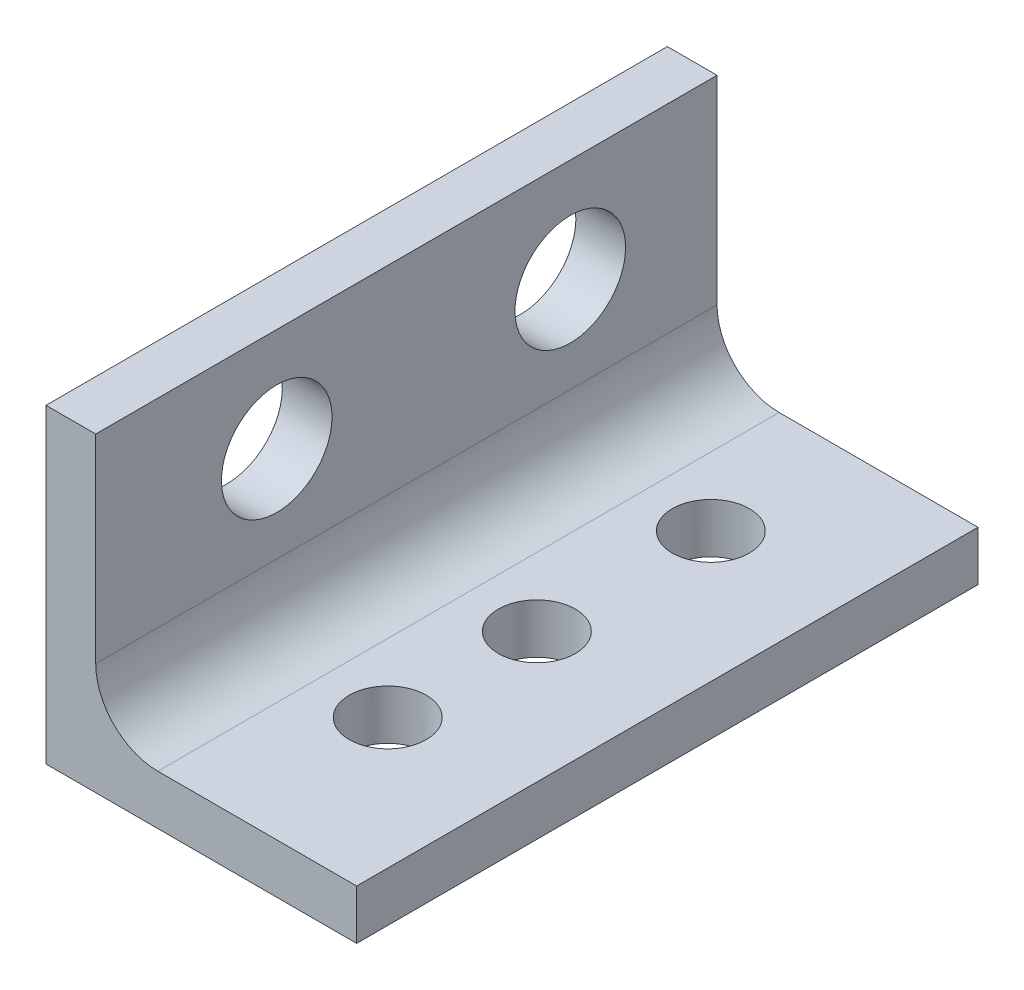
ISO-10303-21;
HEADER;
FILE_DESCRIPTION(('STEP AP214'),'2;1');
FILE_NAME('part.step','',(''),(''),'','','');
FILE_SCHEMA(('AUTOMOTIVE_DESIGN { 1 0 10303 214 1 1 1 1 }'));
ENDSEC;
DATA;
#1=APPLICATION_CONTEXT('core data for automotive mechanical design processes');
#2=APPLICATION_PROTOCOL_DEFINITION('international standard','automotive_design',2000,#1);
#3=PRODUCT_CONTEXT('',#1,'mechanical');
#4=PRODUCT('Part','Part','',(#3));
#5=PRODUCT_RELATED_PRODUCT_CATEGORY('part','',(#4));
#6=PRODUCT_DEFINITION_FORMATION('','',#4);
#7=PRODUCT_DEFINITION_CONTEXT('part definition',#1,'design');
#8=PRODUCT_DEFINITION('design','',#6,#7);
#9=PRODUCT_DEFINITION_SHAPE('','',#8);
#10=(LENGTH_UNIT() NAMED_UNIT(*) SI_UNIT(.MILLI.,.METRE.));
#11=(NAMED_UNIT(*) PLANE_ANGLE_UNIT() SI_UNIT($,.RADIAN.));
#12=(NAMED_UNIT(*) SI_UNIT($,.STERADIAN.) SOLID_ANGLE_UNIT());
#13=UNCERTAINTY_MEASURE_WITH_UNIT(LENGTH_MEASURE(1.E-05),#10,'distance_accuracy_value','');
#14=(GEOMETRIC_REPRESENTATION_CONTEXT(3) GLOBAL_UNCERTAINTY_ASSIGNED_CONTEXT((#13)) GLOBAL_UNIT_ASSIGNED_CONTEXT((#10,
#11,#12)) REPRESENTATION_CONTEXT('',''));
#15=CARTESIAN_POINT('',(0.,0.,0.));
#16=DIRECTION('',(0.,0.,1.));
#17=DIRECTION('',(1.,0.,0.));
#18=AXIS2_PLACEMENT_3D('',#15,#16,#17);
#19=CARTESIAN_POINT('',(-5.334,6.35,12.7));
#20=DIRECTION('',(0.,-1.,0.));
#21=DIRECTION('',(0.,0.,-1.));
#22=AXIS2_PLACEMENT_3D('',#19,#20,#21);
#23=PLANE('',#22);
#24=DIRECTION('',(-1.,0.,0.));
#25=VECTOR('',#24,1.);
#26=CARTESIAN_POINT('',(-5.334,6.35,0.));
#27=LINE('',#26,#25);
#28=CARTESIAN_POINT('',(-5.334,6.35,0.));
#29=VERTEX_POINT('',#28);
#30=CARTESIAN_POINT('',(-6.35,6.35,0.));
#31=VERTEX_POINT('',#30);
#32=EDGE_CURVE('E115',#29,#31,#27,.T.);
#33=ORIENTED_EDGE('',*,*,#32,.T.);
#34=DIRECTION('',(0.,0.,-1.));
#35=VECTOR('',#34,1.);
#36=CARTESIAN_POINT('',(-6.35,6.35,12.7));
#37=LINE('',#36,#35);
#38=CARTESIAN_POINT('',(-6.35,6.35,12.7));
#39=VERTEX_POINT('',#38);
#40=EDGE_CURVE('E96',#39,#31,#37,.T.);
#41=ORIENTED_EDGE('',*,*,#40,.F.);
#42=DIRECTION('',(-1.,0.,0.));
#43=VECTOR('',#42,1.);
#44=CARTESIAN_POINT('',(-5.334,6.35,12.7));
#45=LINE('',#44,#43);
#46=CARTESIAN_POINT('',(-5.334,6.35,12.7));
#47=VERTEX_POINT('',#46);
#48=EDGE_CURVE('E103',#47,#39,#45,.T.);
#49=ORIENTED_EDGE('',*,*,#48,.F.);
#50=DIRECTION('',(0.,0.,-1.));
#51=VECTOR('',#50,1.);
#52=CARTESIAN_POINT('',(-5.334,6.35,12.7));
#53=LINE('',#52,#51);
#54=EDGE_CURVE('E129',#47,#29,#53,.T.);
#55=ORIENTED_EDGE('',*,*,#54,.T.);
#56=EDGE_LOOP('',(#33,#41,#49,#55));
#57=FACE_BOUND('',#56,.T.);
#58=ADVANCED_FACE('F33',(#57),#23,.F.);
#59=CARTESIAN_POINT('',(-6.35,6.35,12.7));
#60=DIRECTION('',(1.,0.,0.));
#61=DIRECTION('',(0.,1.,0.));
#62=AXIS2_PLACEMENT_3D('',#59,#60,#61);
#63=PLANE('',#62);
#64=CARTESIAN_POINT('',(-6.35,4.24,3.));
#65=DIRECTION('',(1.,0.,0.));
#66=DIRECTION('',(0.,1.,0.));
#67=AXIS2_PLACEMENT_3D('',#64,#65,#66);
#68=CIRCLE('',#67,1.1303);
#69=CARTESIAN_POINT('',(-6.35,5.3703,3.));
#70=VERTEX_POINT('',#69);
#71=EDGE_CURVE('E171',#70,#70,#68,.F.);
#72=ORIENTED_EDGE('',*,*,#71,.F.);
#73=EDGE_LOOP('',(#72));
#74=FACE_BOUND('',#73,.T.);
#75=CARTESIAN_POINT('',(-6.35,4.24,9.));
#76=DIRECTION('',(1.,0.,0.));
#77=DIRECTION('',(0.,1.,0.));
#78=AXIS2_PLACEMENT_3D('',#75,#76,#77);
#79=CIRCLE('',#78,1.1303);
#80=CARTESIAN_POINT('',(-6.35,5.3703,9.));
#81=VERTEX_POINT('',#80);
#82=EDGE_CURVE('E165',#81,#81,#79,.F.);
#83=ORIENTED_EDGE('',*,*,#82,.F.);
#84=EDGE_LOOP('',(#83));
#85=FACE_BOUND('',#84,.T.);
#86=DIRECTION('',(0.,-1.,0.));
#87=VECTOR('',#86,1.);
#88=CARTESIAN_POINT('',(-6.35,6.35,0.));
#89=LINE('',#88,#87);
#90=CARTESIAN_POINT('',(-6.35,0.,0.));
#91=VERTEX_POINT('',#90);
#92=EDGE_CURVE('E138',#31,#91,#89,.T.);
#93=ORIENTED_EDGE('',*,*,#92,.T.);
#94=DIRECTION('',(0.,0.,-1.));
#95=VECTOR('',#94,1.);
#96=CARTESIAN_POINT('',(-6.35,0.,12.7));
#97=LINE('',#96,#95);
#98=CARTESIAN_POINT('',(-6.35,0.,12.7));
#99=VERTEX_POINT('',#98);
#100=EDGE_CURVE('E99',#99,#91,#97,.T.);
#101=ORIENTED_EDGE('',*,*,#100,.F.);
#102=DIRECTION('',(0.,-1.,0.));
#103=VECTOR('',#102,1.);
#104=CARTESIAN_POINT('',(-6.35,6.35,12.7));
#105=LINE('',#104,#103);
#106=EDGE_CURVE('E92',#39,#99,#105,.T.);
#107=ORIENTED_EDGE('',*,*,#106,.F.);
#108=ORIENTED_EDGE('',*,*,#40,.T.);
#109=EDGE_LOOP('',(#93,#101,#107,#108));
#110=FACE_BOUND('',#109,.T.);
#111=ADVANCED_FACE('F94',(#74,#85,#110),#63,.F.);
#112=CARTESIAN_POINT('',(-6.35,0.,12.7));
#113=DIRECTION('',(0.,1.,0.));
#114=DIRECTION('',(0.,0.,1.));
#115=AXIS2_PLACEMENT_3D('',#112,#113,#114);
#116=PLANE('',#115);
#117=CARTESIAN_POINT('',(-2.667,0.,2.794));
#118=DIRECTION('',(0.,1.,0.));
#119=DIRECTION('',(0.,0.,1.));
#120=AXIS2_PLACEMENT_3D('',#117,#118,#119);
#121=CIRCLE('',#120,0.7874);
#122=CARTESIAN_POINT('',(-2.667,0.,3.5814));
#123=VERTEX_POINT('',#122);
#124=EDGE_CURVE('E159',#123,#123,#121,.T.);
#125=ORIENTED_EDGE('',*,*,#124,.T.);
#126=EDGE_LOOP('',(#125));
#127=FACE_BOUND('',#126,.T.);
#128=CARTESIAN_POINT('',(-2.667,0.,9.398));
#129=DIRECTION('',(0.,1.,0.));
#130=DIRECTION('',(0.,0.,1.));
#131=AXIS2_PLACEMENT_3D('',#128,#129,#130);
#132=CIRCLE('',#131,0.787400000000001);
#133=CARTESIAN_POINT('',(-2.667,0.,10.1854));
#134=VERTEX_POINT('',#133);
#135=EDGE_CURVE('E153',#134,#134,#132,.T.);
#136=ORIENTED_EDGE('',*,*,#135,.T.);
#137=EDGE_LOOP('',(#136));
#138=FACE_BOUND('',#137,.T.);
#139=CARTESIAN_POINT('',(-2.667,0.,6.35));
#140=DIRECTION('',(0.,1.,0.));
#141=DIRECTION('',(0.,0.,1.));
#142=AXIS2_PLACEMENT_3D('',#139,#140,#141);
#143=CIRCLE('',#142,0.7874);
#144=CARTESIAN_POINT('',(-2.667,0.,7.1374));
#145=VERTEX_POINT('',#144);
#146=EDGE_CURVE('E141',#145,#145,#143,.T.);
#147=ORIENTED_EDGE('',*,*,#146,.T.);
#148=EDGE_LOOP('',(#147));
#149=FACE_BOUND('',#148,.T.);
#150=DIRECTION('',(1.,0.,0.));
#151=VECTOR('',#150,1.);
#152=CARTESIAN_POINT('',(-6.35,0.,0.));
#153=LINE('',#152,#151);
#154=CARTESIAN_POINT('',(0.,0.,0.));
#155=VERTEX_POINT('',#154);
#156=EDGE_CURVE('E136',#91,#155,#153,.T.);
#157=ORIENTED_EDGE('',*,*,#156,.T.);
#158=DIRECTION('',(0.,0.,-1.));
#159=VECTOR('',#158,1.);
#160=CARTESIAN_POINT('',(0.,0.,12.7));
#161=LINE('',#160,#159);
#162=CARTESIAN_POINT('',(0.,0.,12.7));
#163=VERTEX_POINT('',#162);
#164=EDGE_CURVE('E120',#163,#155,#161,.T.);
#165=ORIENTED_EDGE('',*,*,#164,.F.);
#166=DIRECTION('',(1.,0.,0.));
#167=VECTOR('',#166,1.);
#168=CARTESIAN_POINT('',(-6.35,0.,12.7));
#169=LINE('',#168,#167);
#170=EDGE_CURVE('E102',#99,#163,#169,.T.);
#171=ORIENTED_EDGE('',*,*,#170,.F.);
#172=ORIENTED_EDGE('',*,*,#100,.T.);
#173=EDGE_LOOP('',(#157,#165,#171,#172));
#174=FACE_BOUND('',#173,.T.);
#175=ADVANCED_FACE('F200',(#127,#138,#149,#174),#116,.F.);
#176=CARTESIAN_POINT('',(0.,1.016,12.7));
#177=DIRECTION('',(-1.,0.,0.));
#178=DIRECTION('',(0.,0.,1.));
#179=AXIS2_PLACEMENT_3D('',#176,#177,#178);
#180=PLANE('',#179);
#181=DIRECTION('',(0.,1.,0.));
#182=VECTOR('',#181,1.);
#183=CARTESIAN_POINT('',(0.,1.016,0.));
#184=LINE('',#183,#182);
#185=CARTESIAN_POINT('',(0.,1.016,0.));
#186=VERTEX_POINT('',#185);
#187=EDGE_CURVE('E134',#155,#186,#184,.T.);
#188=ORIENTED_EDGE('',*,*,#187,.T.);
#189=DIRECTION('',(0.,0.,-1.));
#190=VECTOR('',#189,1.);
#191=CARTESIAN_POINT('',(0.,1.016,12.7));
#192=LINE('',#191,#190);
#193=CARTESIAN_POINT('',(0.,1.016,12.7));
#194=VERTEX_POINT('',#193);
#195=EDGE_CURVE('E126',#194,#186,#192,.T.);
#196=ORIENTED_EDGE('',*,*,#195,.F.);
#197=DIRECTION('',(0.,1.,0.));
#198=VECTOR('',#197,1.);
#199=CARTESIAN_POINT('',(0.,1.016,12.7));
#200=LINE('',#199,#198);
#201=EDGE_CURVE('E145',#163,#194,#200,.T.);
#202=ORIENTED_EDGE('',*,*,#201,.F.);
#203=ORIENTED_EDGE('',*,*,#164,.T.);
#204=EDGE_LOOP('',(#188,#196,#202,#203));
#205=FACE_BOUND('',#204,.T.);
#206=ADVANCED_FACE('F197',(#205),#180,.F.);
#207=CARTESIAN_POINT('',(-5.334,1.016,12.7));
#208=DIRECTION('',(0.,-1.,0.));
#209=DIRECTION('',(0.,0.,-1.));
#210=AXIS2_PLACEMENT_3D('',#207,#208,#209);
#211=PLANE('',#210);
#212=CARTESIAN_POINT('',(-2.667,1.016,2.794));
#213=DIRECTION('',(0.,1.,0.));
#214=DIRECTION('',(0.,0.,-1.));
#215=AXIS2_PLACEMENT_3D('',#212,#213,#214);
#216=CIRCLE('',#215,0.7874);
#217=CARTESIAN_POINT('',(-2.667,1.016,2.0066));
#218=VERTEX_POINT('',#217);
#219=EDGE_CURVE('E162',#218,#218,#216,.T.);
#220=ORIENTED_EDGE('',*,*,#219,.F.);
#221=EDGE_LOOP('',(#220));
#222=FACE_BOUND('',#221,.T.);
#223=CARTESIAN_POINT('',(-2.667,1.016,9.398));
#224=DIRECTION('',(0.,1.,0.));
#225=DIRECTION('',(0.,0.,-1.));
#226=AXIS2_PLACEMENT_3D('',#223,#224,#225);
#227=CIRCLE('',#226,0.787400000000001);
#228=CARTESIAN_POINT('',(-2.667,1.016,8.6106));
#229=VERTEX_POINT('',#228);
#230=EDGE_CURVE('E156',#229,#229,#227,.T.);
#231=ORIENTED_EDGE('',*,*,#230,.F.);
#232=EDGE_LOOP('',(#231));
#233=FACE_BOUND('',#232,.T.);
#234=CARTESIAN_POINT('',(-2.667,1.016,6.35));
#235=DIRECTION('',(0.,1.,0.));
#236=DIRECTION('',(0.,0.,1.));
#237=AXIS2_PLACEMENT_3D('',#234,#235,#236);
#238=CIRCLE('',#237,0.7874);
#239=CARTESIAN_POINT('',(-2.667,1.016,7.1374));
#240=VERTEX_POINT('',#239);
#241=EDGE_CURVE('E150',#240,#240,#238,.T.);
#242=ORIENTED_EDGE('',*,*,#241,.F.);
#243=EDGE_LOOP('',(#242));
#244=FACE_BOUND('',#243,.T.);
#245=DIRECTION('',(-1.,0.,0.));
#246=VECTOR('',#245,1.);
#247=CARTESIAN_POINT('',(-5.334,1.016,0.));
#248=LINE('',#247,#246);
#249=CARTESIAN_POINT('',(-4.064,1.016,0.));
#250=VERTEX_POINT('',#249);
#251=EDGE_CURVE('E132',#186,#250,#248,.T.);
#252=ORIENTED_EDGE('',*,*,#251,.T.);
#253=DIRECTION('',(0.,0.,-1.));
#254=VECTOR('',#253,1.);
#255=CARTESIAN_POINT('',(-4.064,1.016,12.7));
#256=LINE('',#255,#254);
#257=CARTESIAN_POINT('',(-4.064,1.016,12.7));
#258=VERTEX_POINT('',#257);
#259=EDGE_CURVE('E48',#250,#258,#256,.F.);
#260=ORIENTED_EDGE('',*,*,#259,.T.);
#261=DIRECTION('',(-1.,0.,0.));
#262=VECTOR('',#261,1.);
#263=CARTESIAN_POINT('',(-5.334,1.016,12.7));
#264=LINE('',#263,#262);
#265=EDGE_CURVE('E143',#194,#258,#264,.T.);
#266=ORIENTED_EDGE('',*,*,#265,.F.);
#267=ORIENTED_EDGE('',*,*,#195,.T.);
#268=EDGE_LOOP('',(#252,#260,#266,#267));
#269=FACE_BOUND('',#268,.T.);
#270=ADVANCED_FACE('F184',(#222,#233,#244,#269),#211,.F.);
#271=CARTESIAN_POINT('',(-5.334,6.35,12.7));
#272=DIRECTION('',(-1.,0.,0.));
#273=DIRECTION('',(0.,-1.,0.));
#274=AXIS2_PLACEMENT_3D('',#271,#272,#273);
#275=PLANE('',#274);
#276=CARTESIAN_POINT('',(-5.334,4.24,3.));
#277=DIRECTION('',(1.,0.,0.));
#278=DIRECTION('',(0.,1.,0.));
#279=AXIS2_PLACEMENT_3D('',#276,#277,#278);
#280=CIRCLE('',#279,1.1303);
#281=CARTESIAN_POINT('',(-5.334,5.3703,3.));
#282=VERTEX_POINT('',#281);
#283=EDGE_CURVE('E174',#282,#282,#280,.T.);
#284=ORIENTED_EDGE('',*,*,#283,.F.);
#285=EDGE_LOOP('',(#284));
#286=FACE_BOUND('',#285,.T.);
#287=CARTESIAN_POINT('',(-5.334,4.24,9.));
#288=DIRECTION('',(1.,0.,0.));
#289=DIRECTION('',(0.,1.,0.));
#290=AXIS2_PLACEMENT_3D('',#287,#288,#289);
#291=CIRCLE('',#290,1.1303);
#292=CARTESIAN_POINT('',(-5.334,5.3703,9.));
#293=VERTEX_POINT('',#292);
#294=EDGE_CURVE('E168',#293,#293,#291,.T.);
#295=ORIENTED_EDGE('',*,*,#294,.F.);
#296=EDGE_LOOP('',(#295));
#297=FACE_BOUND('',#296,.T.);
#298=DIRECTION('',(0.,1.,0.));
#299=VECTOR('',#298,1.);
#300=CARTESIAN_POINT('',(-5.334,6.35,12.7));
#301=LINE('',#300,#299);
#302=CARTESIAN_POINT('',(-5.334,2.286,12.7));
#303=VERTEX_POINT('',#302);
#304=EDGE_CURVE('E108',#303,#47,#301,.T.);
#305=ORIENTED_EDGE('',*,*,#304,.F.);
#306=DIRECTION('',(0.,0.,-1.));
#307=VECTOR('',#306,1.);
#308=CARTESIAN_POINT('',(-5.334,2.286,0.));
#309=LINE('',#308,#307);
#310=CARTESIAN_POINT('',(-5.334,2.286,0.));
#311=VERTEX_POINT('',#310);
#312=EDGE_CURVE('E116',#303,#311,#309,.T.);
#313=ORIENTED_EDGE('',*,*,#312,.T.);
#314=DIRECTION('',(0.,1.,0.));
#315=VECTOR('',#314,1.);
#316=CARTESIAN_POINT('',(-5.334,6.35,0.));
#317=LINE('',#316,#315);
#318=EDGE_CURVE('E112',#311,#29,#317,.T.);
#319=ORIENTED_EDGE('',*,*,#318,.T.);
#320=ORIENTED_EDGE('',*,*,#54,.F.);
#321=EDGE_LOOP('',(#305,#313,#319,#320));
#322=FACE_BOUND('',#321,.T.);
#323=ADVANCED_FACE('F181',(#286,#297,#322),#275,.F.);
#324=CARTESIAN_POINT('',(0.,0.,12.7));
#325=DIRECTION('',(0.,0.,1.));
#326=DIRECTION('',(1.,0.,0.));
#327=AXIS2_PLACEMENT_3D('',#324,#325,#326);
#328=PLANE('',#327);
#329=ORIENTED_EDGE('',*,*,#48,.T.);
#330=ORIENTED_EDGE('',*,*,#106,.T.);
#331=ORIENTED_EDGE('',*,*,#170,.T.);
#332=ORIENTED_EDGE('',*,*,#201,.T.);
#333=ORIENTED_EDGE('',*,*,#265,.T.);
#334=CARTESIAN_POINT('',(-4.064,2.286,12.7));
#335=DIRECTION('',(0.,0.,1.));
#336=DIRECTION('',(1.,0.,0.));
#337=AXIS2_PLACEMENT_3D('',#334,#335,#336);
#338=CIRCLE('',#337,1.27);
#339=EDGE_CURVE('E11',#258,#303,#338,.F.);
#340=ORIENTED_EDGE('',*,*,#339,.T.);
#341=ORIENTED_EDGE('',*,*,#304,.T.);
#342=EDGE_LOOP('',(#329,#330,#331,#332,#333,#340,#341));
#343=FACE_BOUND('',#342,.T.);
#344=ADVANCED_FACE('F106',(#343),#328,.T.);
#345=CARTESIAN_POINT('',(0.,0.,0.));
#346=DIRECTION('',(0.,0.,1.));
#347=DIRECTION('',(1.,0.,0.));
#348=AXIS2_PLACEMENT_3D('',#345,#346,#347);
#349=PLANE('',#348);
#350=ORIENTED_EDGE('',*,*,#32,.F.);
#351=ORIENTED_EDGE('',*,*,#318,.F.);
#352=CARTESIAN_POINT('',(-4.064,2.286,0.));
#353=DIRECTION('',(0.,0.,1.));
#354=DIRECTION('',(1.,0.,0.));
#355=AXIS2_PLACEMENT_3D('',#352,#353,#354);
#356=CIRCLE('',#355,1.27);
#357=EDGE_CURVE('E41',#311,#250,#356,.T.);
#358=ORIENTED_EDGE('',*,*,#357,.T.);
#359=ORIENTED_EDGE('',*,*,#251,.F.);
#360=ORIENTED_EDGE('',*,*,#187,.F.);
#361=ORIENTED_EDGE('',*,*,#156,.F.);
#362=ORIENTED_EDGE('',*,*,#92,.F.);
#363=EDGE_LOOP('',(#350,#351,#358,#359,#360,#361,#362));
#364=FACE_BOUND('',#363,.T.);
#365=ADVANCED_FACE('F195',(#364),#349,.F.);
#366=CARTESIAN_POINT('',(-2.667,-1.524,6.35));
#367=DIRECTION('',(0.,1.,0.));
#368=DIRECTION('',(0.,0.,1.));
#369=AXIS2_PLACEMENT_3D('',#366,#367,#368);
#370=CYLINDRICAL_SURFACE('',#369,0.7874);
#371=ORIENTED_EDGE('',*,*,#241,.T.);
#372=EDGE_LOOP('',(#371));
#373=FACE_BOUND('',#372,.T.);
#374=ORIENTED_EDGE('',*,*,#146,.F.);
#375=EDGE_LOOP('',(#374));
#376=FACE_BOUND('',#375,.T.);
#377=ADVANCED_FACE('F266',(#373,#376),#370,.F.);
#378=CARTESIAN_POINT('',(-2.667,-1.524,9.398));
#379=DIRECTION('',(0.,1.,0.));
#380=DIRECTION('',(0.,0.,1.));
#381=AXIS2_PLACEMENT_3D('',#378,#379,#380);
#382=CYLINDRICAL_SURFACE('',#381,0.787400000000001);
#383=ORIENTED_EDGE('',*,*,#230,.T.);
#384=EDGE_LOOP('',(#383));
#385=FACE_BOUND('',#384,.T.);
#386=ORIENTED_EDGE('',*,*,#135,.F.);
#387=EDGE_LOOP('',(#386));
#388=FACE_BOUND('',#387,.T.);
#389=ADVANCED_FACE('F262',(#385,#388),#382,.F.);
#390=CARTESIAN_POINT('',(-2.667,-1.524,2.794));
#391=DIRECTION('',(0.,1.,0.));
#392=DIRECTION('',(0.,0.,1.));
#393=AXIS2_PLACEMENT_3D('',#390,#391,#392);
#394=CYLINDRICAL_SURFACE('',#393,0.7874);
#395=ORIENTED_EDGE('',*,*,#219,.T.);
#396=EDGE_LOOP('',(#395));
#397=FACE_BOUND('',#396,.T.);
#398=ORIENTED_EDGE('',*,*,#124,.F.);
#399=EDGE_LOOP('',(#398));
#400=FACE_BOUND('',#399,.T.);
#401=ADVANCED_FACE('F259',(#397,#400),#394,.F.);
#402=CARTESIAN_POINT('',(-4.064,2.286,12.7));
#403=DIRECTION('',(0.,0.,1.));
#404=DIRECTION('',(1.,0.,0.));
#405=AXIS2_PLACEMENT_3D('',#402,#403,#404);
#406=CYLINDRICAL_SURFACE('',#405,1.27);
#407=ORIENTED_EDGE('',*,*,#339,.F.);
#408=ORIENTED_EDGE('',*,*,#259,.F.);
#409=ORIENTED_EDGE('',*,*,#357,.F.);
#410=ORIENTED_EDGE('',*,*,#312,.F.);
#411=EDGE_LOOP('',(#407,#408,#409,#410));
#412=FACE_BOUND('',#411,.T.);
#413=ADVANCED_FACE('F35',(#412),#406,.F.);
#414=CARTESIAN_POINT('',(-6.351,4.24,9.));
#415=DIRECTION('',(1.,0.,0.));
#416=DIRECTION('',(0.,1.,0.));
#417=AXIS2_PLACEMENT_3D('',#414,#415,#416);
#418=CYLINDRICAL_SURFACE('',#417,1.1303);
#419=ORIENTED_EDGE('',*,*,#294,.T.);
#420=EDGE_LOOP('',(#419));
#421=FACE_BOUND('',#420,.T.);
#422=ORIENTED_EDGE('',*,*,#82,.T.);
#423=EDGE_LOOP('',(#422));
#424=FACE_BOUND('',#423,.T.);
#425=ADVANCED_FACE('F241',(#421,#424),#418,.F.);
#426=CARTESIAN_POINT('',(-6.351,4.24,3.));
#427=DIRECTION('',(1.,0.,0.));
#428=DIRECTION('',(0.,1.,0.));
#429=AXIS2_PLACEMENT_3D('',#426,#427,#428);
#430=CYLINDRICAL_SURFACE('',#429,1.1303);
#431=ORIENTED_EDGE('',*,*,#283,.T.);
#432=EDGE_LOOP('',(#431));
#433=FACE_BOUND('',#432,.T.);
#434=ORIENTED_EDGE('',*,*,#71,.T.);
#435=EDGE_LOOP('',(#434));
#436=FACE_BOUND('',#435,.T.);
#437=ADVANCED_FACE('F178',(#433,#436),#430,.F.);
#438=CLOSED_SHELL('',(#58,#111,#175,#206,#270,#323,#344,#365,#377,#389,#401,#413,#425,#437));
#439=MANIFOLD_SOLID_BREP('B2',#438);
#440=ADVANCED_BREP_SHAPE_REPRESENTATION('',(#18,#439),#14);
#441=SHAPE_DEFINITION_REPRESENTATION(#9,#440);
ENDSEC;
END-ISO-10303-21;
